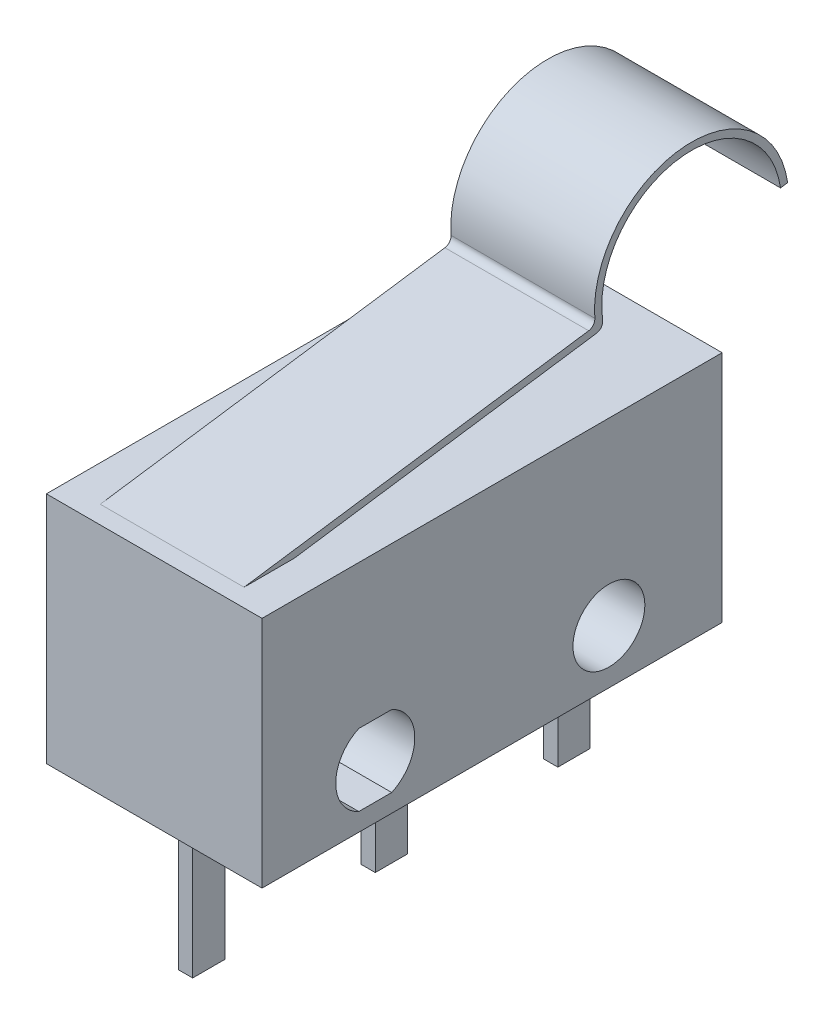
ISO-10303-21;
HEADER;
FILE_DESCRIPTION(('STEP AP214'),'2;1');
FILE_NAME('part.step','',(''),(''),'','','');
FILE_SCHEMA(('AUTOMOTIVE_DESIGN { 1 0 10303 214 1 1 1 1 }'));
ENDSEC;
DATA;
#1=APPLICATION_CONTEXT('core data for automotive mechanical design processes');
#2=APPLICATION_PROTOCOL_DEFINITION('international standard','automotive_design',2000,#1);
#3=PRODUCT_CONTEXT('',#1,'mechanical');
#4=PRODUCT('Part','Part','',(#3));
#5=PRODUCT_RELATED_PRODUCT_CATEGORY('part','',(#4));
#6=PRODUCT_DEFINITION_FORMATION('','',#4);
#7=PRODUCT_DEFINITION_CONTEXT('part definition',#1,'design');
#8=PRODUCT_DEFINITION('design','',#6,#7);
#9=PRODUCT_DEFINITION_SHAPE('','',#8);
#10=(LENGTH_UNIT() NAMED_UNIT(*) SI_UNIT(.MILLI.,.METRE.));
#11=(NAMED_UNIT(*) PLANE_ANGLE_UNIT() SI_UNIT($,.RADIAN.));
#12=(NAMED_UNIT(*) SI_UNIT($,.STERADIAN.) SOLID_ANGLE_UNIT());
#13=UNCERTAINTY_MEASURE_WITH_UNIT(LENGTH_MEASURE(1.E-05),#10,'distance_accuracy_value','');
#14=(GEOMETRIC_REPRESENTATION_CONTEXT(3) GLOBAL_UNCERTAINTY_ASSIGNED_CONTEXT((#13)) GLOBAL_UNIT_ASSIGNED_CONTEXT((#10,
#11,#12)) REPRESENTATION_CONTEXT('',''));
#15=CARTESIAN_POINT('',(0.,0.,0.));
#16=DIRECTION('',(0.,0.,1.));
#17=DIRECTION('',(1.,0.,0.));
#18=AXIS2_PLACEMENT_3D('',#15,#16,#17);
#19=CARTESIAN_POINT('',(3.,3.25,-6.4));
#20=DIRECTION('',(0.,-1.,0.));
#21=DIRECTION('',(0.,0.,-1.));
#22=AXIS2_PLACEMENT_3D('',#19,#20,#21);
#23=PLANE('',#22);
#24=DIRECTION('',(-1.,0.,0.));
#25=VECTOR('',#24,1.);
#26=CARTESIAN_POINT('',(0.5,3.25,1.82));
#27=LINE('',#26,#25);
#28=CARTESIAN_POINT('',(0.5,3.25,1.82));
#29=VERTEX_POINT('',#28);
#30=CARTESIAN_POINT('',(-0.5,3.25,1.82));
#31=VERTEX_POINT('',#30);
#32=EDGE_CURVE('E54',#29,#31,#27,.T.);
#33=ORIENTED_EDGE('',*,*,#32,.F.);
#34=DIRECTION('',(0.,0.,-1.));
#35=VECTOR('',#34,1.);
#36=CARTESIAN_POINT('',(0.5,3.25,2.48));
#37=LINE('',#36,#35);
#38=CARTESIAN_POINT('',(0.5,3.25,2.48));
#39=VERTEX_POINT('',#38);
#40=EDGE_CURVE('E49',#39,#29,#37,.T.);
#41=ORIENTED_EDGE('',*,*,#40,.F.);
#42=DIRECTION('',(-1.,0.,0.));
#43=VECTOR('',#42,1.);
#44=CARTESIAN_POINT('',(0.5,3.25,2.48));
#45=LINE('',#44,#43);
#46=CARTESIAN_POINT('',(-0.5,3.25,2.48));
#47=VERTEX_POINT('',#46);
#48=EDGE_CURVE('E226',#39,#47,#45,.T.);
#49=ORIENTED_EDGE('',*,*,#48,.T.);
#50=DIRECTION('',(0.,0.,-1.));
#51=VECTOR('',#50,1.);
#52=CARTESIAN_POINT('',(-0.5,3.25,2.48));
#53=LINE('',#52,#51);
#54=EDGE_CURVE('E229',#47,#31,#53,.T.);
#55=ORIENTED_EDGE('',*,*,#54,.T.);
#56=EDGE_LOOP('',(#33,#41,#49,#55));
#57=FACE_BOUND('',#56,.T.);
#58=DIRECTION('',(0.,0.,1.));
#59=VECTOR('',#58,1.);
#60=CARTESIAN_POINT('',(-3.,3.25,-6.4));
#61=LINE('',#60,#59);
#62=CARTESIAN_POINT('',(-3.,3.25,-6.4));
#63=VERTEX_POINT('',#62);
#64=CARTESIAN_POINT('',(-3.,3.25,6.4));
#65=VERTEX_POINT('',#64);
#66=EDGE_CURVE('E421',#63,#65,#61,.T.);
#67=ORIENTED_EDGE('',*,*,#66,.T.);
#68=DIRECTION('',(-1.,0.,0.));
#69=VECTOR('',#68,1.);
#70=CARTESIAN_POINT('',(3.,3.25,6.4));
#71=LINE('',#70,#69);
#72=CARTESIAN_POINT('',(3.,3.25,6.4));
#73=VERTEX_POINT('',#72);
#74=EDGE_CURVE('E427',#73,#65,#71,.T.);
#75=ORIENTED_EDGE('',*,*,#74,.F.);
#76=DIRECTION('',(0.,0.,1.));
#77=VECTOR('',#76,1.);
#78=CARTESIAN_POINT('',(3.,3.25,-6.4));
#79=LINE('',#78,#77);
#80=CARTESIAN_POINT('',(3.,3.25,-6.4));
#81=VERTEX_POINT('',#80);
#82=EDGE_CURVE('E425',#81,#73,#79,.T.);
#83=ORIENTED_EDGE('',*,*,#82,.F.);
#84=DIRECTION('',(-1.,0.,0.));
#85=VECTOR('',#84,1.);
#86=CARTESIAN_POINT('',(3.,3.25,-6.4));
#87=LINE('',#86,#85);
#88=EDGE_CURVE('E437',#81,#63,#87,.T.);
#89=ORIENTED_EDGE('',*,*,#88,.T.);
#90=EDGE_LOOP('',(#67,#75,#83,#89));
#91=FACE_BOUND('',#90,.T.);
#92=DIRECTION('',(0.,0.,-1.));
#93=VECTOR('',#92,1.);
#94=CARTESIAN_POINT('',(2.,3.25,4.5022836084845));
#95=LINE('',#94,#93);
#96=CARTESIAN_POINT('',(2.,3.25,5.9));
#97=VERTEX_POINT('',#96);
#98=CARTESIAN_POINT('',(2.,3.25,4.5022836084845));
#99=VERTEX_POINT('',#98);
#100=EDGE_CURVE('E247',#97,#99,#95,.T.);
#101=ORIENTED_EDGE('',*,*,#100,.F.);
#102=DIRECTION('',(-1.,0.,0.));
#103=VECTOR('',#102,1.);
#104=CARTESIAN_POINT('',(2.,3.25,5.9));
#105=LINE('',#104,#103);
#106=CARTESIAN_POINT('',(-2.,3.25,5.9));
#107=VERTEX_POINT('',#106);
#108=EDGE_CURVE('E263',#97,#107,#105,.T.);
#109=ORIENTED_EDGE('',*,*,#108,.T.);
#110=DIRECTION('',(0.,0.,-1.));
#111=VECTOR('',#110,1.);
#112=CARTESIAN_POINT('',(-2.,3.25,4.5022836084845));
#113=LINE('',#112,#111);
#114=CARTESIAN_POINT('',(-2.,3.25,4.5022836084845));
#115=VERTEX_POINT('',#114);
#116=EDGE_CURVE('E233',#107,#115,#113,.T.);
#117=ORIENTED_EDGE('',*,*,#116,.T.);
#118=DIRECTION('',(-1.,0.,0.));
#119=VECTOR('',#118,1.);
#120=CARTESIAN_POINT('',(2.,3.25,4.5022836084845));
#121=LINE('',#120,#119);
#122=EDGE_CURVE('E285',#99,#115,#121,.T.);
#123=ORIENTED_EDGE('',*,*,#122,.F.);
#124=EDGE_LOOP('',(#101,#109,#117,#123));
#125=FACE_BOUND('',#124,.T.);
#126=ADVANCED_FACE('F34',(#57,#91,#125),#23,.F.);
#127=CARTESIAN_POINT('',(3.,-3.25,-6.4));
#128=DIRECTION('',(0.,1.,0.));
#129=DIRECTION('',(0.,0.,1.));
#130=AXIS2_PLACEMENT_3D('',#127,#128,#129);
#131=PLANE('',#130);
#132=DIRECTION('',(-1.,0.,0.));
#133=VECTOR('',#132,1.);
#134=CARTESIAN_POINT('',(0.2,-3.25,-4.63));
#135=LINE('',#134,#133);
#136=CARTESIAN_POINT('',(0.2,-3.25,-4.63));
#137=VERTEX_POINT('',#136);
#138=CARTESIAN_POINT('',(-0.2,-3.25,-4.63));
#139=VERTEX_POINT('',#138);
#140=EDGE_CURVE('E300',#137,#139,#135,.T.);
#141=ORIENTED_EDGE('',*,*,#140,.F.);
#142=DIRECTION('',(0.,0.,1.));
#143=VECTOR('',#142,1.);
#144=CARTESIAN_POINT('',(0.2,-3.25,-4.63));
#145=LINE('',#144,#143);
#146=CARTESIAN_POINT('',(0.2,-3.25,-5.53));
#147=VERTEX_POINT('',#146);
#148=EDGE_CURVE('E297',#147,#137,#145,.T.);
#149=ORIENTED_EDGE('',*,*,#148,.F.);
#150=DIRECTION('',(-1.,0.,0.));
#151=VECTOR('',#150,1.);
#152=CARTESIAN_POINT('',(0.2,-3.25,-5.53));
#153=LINE('',#152,#151);
#154=CARTESIAN_POINT('',(-0.2,-3.25,-5.53));
#155=VERTEX_POINT('',#154);
#156=EDGE_CURVE('E311',#147,#155,#153,.T.);
#157=ORIENTED_EDGE('',*,*,#156,.T.);
#158=DIRECTION('',(0.,0.,1.));
#159=VECTOR('',#158,1.);
#160=CARTESIAN_POINT('',(-0.2,-3.25,-4.63));
#161=LINE('',#160,#159);
#162=EDGE_CURVE('E292',#155,#139,#161,.T.);
#163=ORIENTED_EDGE('',*,*,#162,.T.);
#164=EDGE_LOOP('',(#141,#149,#157,#163));
#165=FACE_BOUND('',#164,.T.);
#166=DIRECTION('',(0.,0.,-1.));
#167=VECTOR('',#166,1.);
#168=CARTESIAN_POINT('',(-3.,-3.25,-6.4));
#169=LINE('',#168,#167);
#170=CARTESIAN_POINT('',(-3.,-3.25,6.4));
#171=VERTEX_POINT('',#170);
#172=CARTESIAN_POINT('',(-3.,-3.25,-6.4));
#173=VERTEX_POINT('',#172);
#174=EDGE_CURVE('E430',#171,#173,#169,.T.);
#175=ORIENTED_EDGE('',*,*,#174,.T.);
#176=DIRECTION('',(-1.,0.,0.));
#177=VECTOR('',#176,1.);
#178=CARTESIAN_POINT('',(3.,-3.25,-6.4));
#179=LINE('',#178,#177);
#180=CARTESIAN_POINT('',(3.,-3.25,-6.4));
#181=VERTEX_POINT('',#180);
#182=EDGE_CURVE('E440',#181,#173,#179,.T.);
#183=ORIENTED_EDGE('',*,*,#182,.F.);
#184=DIRECTION('',(0.,0.,-1.));
#185=VECTOR('',#184,1.);
#186=CARTESIAN_POINT('',(3.,-3.25,-6.4));
#187=LINE('',#186,#185);
#188=CARTESIAN_POINT('',(3.,-3.25,6.4));
#189=VERTEX_POINT('',#188);
#190=EDGE_CURVE('E420',#189,#181,#187,.T.);
#191=ORIENTED_EDGE('',*,*,#190,.F.);
#192=DIRECTION('',(-1.,0.,0.));
#193=VECTOR('',#192,1.);
#194=CARTESIAN_POINT('',(3.,-3.25,6.4));
#195=LINE('',#194,#193);
#196=EDGE_CURVE('E443',#189,#171,#195,.T.);
#197=ORIENTED_EDGE('',*,*,#196,.T.);
#198=EDGE_LOOP('',(#175,#183,#191,#197));
#199=FACE_BOUND('',#198,.T.);
#200=DIRECTION('',(-1.,0.,0.));
#201=VECTOR('',#200,1.);
#202=CARTESIAN_POINT('',(0.2,-3.25,5.53));
#203=LINE('',#202,#201);
#204=CARTESIAN_POINT('',(0.2,-3.25,5.53));
#205=VERTEX_POINT('',#204);
#206=CARTESIAN_POINT('',(-0.2,-3.25,5.53));
#207=VERTEX_POINT('',#206);
#208=EDGE_CURVE('E376',#205,#207,#203,.T.);
#209=ORIENTED_EDGE('',*,*,#208,.F.);
#210=DIRECTION('',(0.,0.,1.));
#211=VECTOR('',#210,1.);
#212=CARTESIAN_POINT('',(0.2,-3.25,4.63));
#213=LINE('',#212,#211);
#214=CARTESIAN_POINT('',(0.2,-3.25,4.63));
#215=VERTEX_POINT('',#214);
#216=EDGE_CURVE('E350',#215,#205,#213,.T.);
#217=ORIENTED_EDGE('',*,*,#216,.F.);
#218=DIRECTION('',(-1.,0.,0.));
#219=VECTOR('',#218,1.);
#220=CARTESIAN_POINT('',(0.2,-3.25,4.63));
#221=LINE('',#220,#219);
#222=CARTESIAN_POINT('',(-0.2,-3.25,4.63));
#223=VERTEX_POINT('',#222);
#224=EDGE_CURVE('E361',#215,#223,#221,.T.);
#225=ORIENTED_EDGE('',*,*,#224,.T.);
#226=DIRECTION('',(0.,0.,1.));
#227=VECTOR('',#226,1.);
#228=CARTESIAN_POINT('',(-0.2,-3.25,4.63));
#229=LINE('',#228,#227);
#230=EDGE_CURVE('E349',#223,#207,#229,.T.);
#231=ORIENTED_EDGE('',*,*,#230,.T.);
#232=EDGE_LOOP('',(#209,#217,#225,#231));
#233=FACE_BOUND('',#232,.T.);
#234=DIRECTION('',(0.,0.,1.));
#235=VECTOR('',#234,1.);
#236=CARTESIAN_POINT('',(0.2,-3.25,-0.45));
#237=LINE('',#236,#235);
#238=CARTESIAN_POINT('',(0.2,-3.25,-0.45));
#239=VERTEX_POINT('',#238);
#240=CARTESIAN_POINT('',(0.2,-3.25,0.45));
#241=VERTEX_POINT('',#240);
#242=EDGE_CURVE('E322',#239,#241,#237,.T.);
#243=ORIENTED_EDGE('',*,*,#242,.F.);
#244=DIRECTION('',(-1.,0.,0.));
#245=VECTOR('',#244,1.);
#246=CARTESIAN_POINT('',(0.2,-3.25,-0.45));
#247=LINE('',#246,#245);
#248=CARTESIAN_POINT('',(-0.2,-3.25,-0.45));
#249=VERTEX_POINT('',#248);
#250=EDGE_CURVE('E346',#239,#249,#247,.T.);
#251=ORIENTED_EDGE('',*,*,#250,.T.);
#252=DIRECTION('',(0.,0.,1.));
#253=VECTOR('',#252,1.);
#254=CARTESIAN_POINT('',(-0.2,-3.25,-0.45));
#255=LINE('',#254,#253);
#256=CARTESIAN_POINT('',(-0.2,-3.25,0.450000000000001));
#257=VERTEX_POINT('',#256);
#258=EDGE_CURVE('E332',#249,#257,#255,.T.);
#259=ORIENTED_EDGE('',*,*,#258,.T.);
#260=DIRECTION('',(-1.,0.,0.));
#261=VECTOR('',#260,1.);
#262=CARTESIAN_POINT('',(0.2,-3.25,0.45));
#263=LINE('',#262,#261);
#264=EDGE_CURVE('E343',#241,#257,#263,.T.);
#265=ORIENTED_EDGE('',*,*,#264,.F.);
#266=EDGE_LOOP('',(#243,#251,#259,#265));
#267=FACE_BOUND('',#266,.T.);
#268=ADVANCED_FACE('F507',(#165,#199,#233,#267),#131,.F.);
#269=CARTESIAN_POINT('',(3.,0.,0.));
#270=DIRECTION('',(-1.,0.,0.));
#271=DIRECTION('',(0.,0.,1.));
#272=AXIS2_PLACEMENT_3D('',#269,#270,#271);
#273=PLANE('',#272);
#274=CARTESIAN_POINT('',(3.,-1.75,-3.25));
#275=DIRECTION('',(1.,0.,0.));
#276=DIRECTION('',(0.,0.,-1.));
#277=AXIS2_PLACEMENT_3D('',#274,#275,#276);
#278=CIRCLE('',#277,0.999999999999999);
#279=CARTESIAN_POINT('',(3.,-1.75,-4.25));
#280=VERTEX_POINT('',#279);
#281=EDGE_CURVE('E411',#280,#280,#278,.T.);
#282=ORIENTED_EDGE('',*,*,#281,.F.);
#283=EDGE_LOOP('',(#282));
#284=FACE_BOUND('',#283,.T.);
#285=DIRECTION('',(0.,-1.,0.));
#286=VECTOR('',#285,1.);
#287=CARTESIAN_POINT('',(3.,3.25,6.4));
#288=LINE('',#287,#286);
#289=EDGE_CURVE('E417',#73,#189,#288,.T.);
#290=ORIENTED_EDGE('',*,*,#289,.T.);
#291=ORIENTED_EDGE('',*,*,#190,.T.);
#292=DIRECTION('',(0.,1.,0.));
#293=VECTOR('',#292,1.);
#294=CARTESIAN_POINT('',(3.,3.25,-6.4));
#295=LINE('',#294,#293);
#296=EDGE_CURVE('E423',#181,#81,#295,.T.);
#297=ORIENTED_EDGE('',*,*,#296,.T.);
#298=ORIENTED_EDGE('',*,*,#82,.T.);
#299=EDGE_LOOP('',(#290,#291,#297,#298));
#300=FACE_BOUND('',#299,.T.);
#301=CARTESIAN_POINT('',(3.,-1.75,3.25));
#302=DIRECTION('',(1.,0.,0.));
#303=DIRECTION('',(0.,0.,-1.));
#304=AXIS2_PLACEMENT_3D('',#301,#302,#303);
#305=CIRCLE('',#304,1.1);
#306=CARTESIAN_POINT('',(3.,-0.75,3.70825756949558));
#307=VERTEX_POINT('',#306);
#308=CARTESIAN_POINT('',(3.,-2.75,3.70825756949558));
#309=VERTEX_POINT('',#308);
#310=EDGE_CURVE('E380',#307,#309,#305,.T.);
#311=ORIENTED_EDGE('',*,*,#310,.F.);
#312=DIRECTION('',(0.,0.,1.));
#313=VECTOR('',#312,1.);
#314=CARTESIAN_POINT('',(3.,-0.75,3.70825756949558));
#315=LINE('',#314,#313);
#316=CARTESIAN_POINT('',(3.,-0.75,2.79174243050441));
#317=VERTEX_POINT('',#316);
#318=EDGE_CURVE('E388',#317,#307,#315,.T.);
#319=ORIENTED_EDGE('',*,*,#318,.F.);
#320=CARTESIAN_POINT('',(3.,-1.75,3.25));
#321=DIRECTION('',(1.,0.,0.));
#322=DIRECTION('',(0.,0.,-1.));
#323=AXIS2_PLACEMENT_3D('',#320,#321,#322);
#324=CIRCLE('',#323,1.1);
#325=CARTESIAN_POINT('',(3.,-2.75,2.79174243050442));
#326=VERTEX_POINT('',#325);
#327=EDGE_CURVE('E385',#326,#317,#324,.T.);
#328=ORIENTED_EDGE('',*,*,#327,.F.);
#329=DIRECTION('',(0.,0.,-1.));
#330=VECTOR('',#329,1.);
#331=CARTESIAN_POINT('',(3.,-2.75,3.70825756949558));
#332=LINE('',#331,#330);
#333=EDGE_CURVE('E382',#309,#326,#332,.T.);
#334=ORIENTED_EDGE('',*,*,#333,.F.);
#335=EDGE_LOOP('',(#311,#319,#328,#334));
#336=FACE_BOUND('',#335,.T.);
#337=ADVANCED_FACE('F512',(#284,#300,#336),#273,.F.);
#338=CARTESIAN_POINT('',(-3.,0.,0.));
#339=DIRECTION('',(-1.,0.,0.));
#340=DIRECTION('',(0.,0.,1.));
#341=AXIS2_PLACEMENT_3D('',#338,#339,#340);
#342=PLANE('',#341);
#343=DIRECTION('',(0.,-1.,0.));
#344=VECTOR('',#343,1.);
#345=CARTESIAN_POINT('',(-3.,3.25,6.4));
#346=LINE('',#345,#344);
#347=EDGE_CURVE('E414',#65,#171,#346,.T.);
#348=ORIENTED_EDGE('',*,*,#347,.F.);
#349=ORIENTED_EDGE('',*,*,#66,.F.);
#350=DIRECTION('',(0.,1.,0.));
#351=VECTOR('',#350,1.);
#352=CARTESIAN_POINT('',(-3.,3.25,-6.4));
#353=LINE('',#352,#351);
#354=EDGE_CURVE('E432',#173,#63,#353,.T.);
#355=ORIENTED_EDGE('',*,*,#354,.F.);
#356=ORIENTED_EDGE('',*,*,#174,.F.);
#357=EDGE_LOOP('',(#348,#349,#355,#356));
#358=FACE_BOUND('',#357,.T.);
#359=CARTESIAN_POINT('',(-3.,-1.75,-3.25));
#360=DIRECTION('',(1.,0.,0.));
#361=DIRECTION('',(0.,0.,-1.));
#362=AXIS2_PLACEMENT_3D('',#359,#360,#361);
#363=CIRCLE('',#362,0.999999999999999);
#364=CARTESIAN_POINT('',(-3.,-1.75,-4.25));
#365=VERTEX_POINT('',#364);
#366=EDGE_CURVE('E410',#365,#365,#363,.T.);
#367=ORIENTED_EDGE('',*,*,#366,.T.);
#368=EDGE_LOOP('',(#367));
#369=FACE_BOUND('',#368,.T.);
#370=DIRECTION('',(0.,0.,1.));
#371=VECTOR('',#370,1.);
#372=CARTESIAN_POINT('',(-3.,-0.75,3.70825756949558));
#373=LINE('',#372,#371);
#374=CARTESIAN_POINT('',(-3.,-0.75,2.79174243050441));
#375=VERTEX_POINT('',#374);
#376=CARTESIAN_POINT('',(-3.,-0.75,3.70825756949558));
#377=VERTEX_POINT('',#376);
#378=EDGE_CURVE('E383',#375,#377,#373,.T.);
#379=ORIENTED_EDGE('',*,*,#378,.T.);
#380=CARTESIAN_POINT('',(-3.,-1.75,3.25));
#381=DIRECTION('',(1.,0.,0.));
#382=DIRECTION('',(0.,0.,-1.));
#383=AXIS2_PLACEMENT_3D('',#380,#381,#382);
#384=CIRCLE('',#383,1.1);
#385=CARTESIAN_POINT('',(-3.,-2.75,3.70825756949558));
#386=VERTEX_POINT('',#385);
#387=EDGE_CURVE('E379',#377,#386,#384,.T.);
#388=ORIENTED_EDGE('',*,*,#387,.T.);
#389=DIRECTION('',(0.,0.,-1.));
#390=VECTOR('',#389,1.);
#391=CARTESIAN_POINT('',(-3.,-2.75,3.70825756949558));
#392=LINE('',#391,#390);
#393=CARTESIAN_POINT('',(-3.,-2.75,2.79174243050442));
#394=VERTEX_POINT('',#393);
#395=EDGE_CURVE('E393',#386,#394,#392,.T.);
#396=ORIENTED_EDGE('',*,*,#395,.T.);
#397=CARTESIAN_POINT('',(-3.,-1.75,3.25));
#398=DIRECTION('',(1.,0.,0.));
#399=DIRECTION('',(0.,0.,-1.));
#400=AXIS2_PLACEMENT_3D('',#397,#398,#399);
#401=CIRCLE('',#400,1.1);
#402=EDGE_CURVE('E396',#394,#375,#401,.T.);
#403=ORIENTED_EDGE('',*,*,#402,.T.);
#404=EDGE_LOOP('',(#379,#388,#396,#403));
#405=FACE_BOUND('',#404,.T.);
#406=ADVANCED_FACE('F517',(#358,#369,#405),#342,.T.);
#407=CARTESIAN_POINT('',(3.,3.25,6.4));
#408=DIRECTION('',(0.,0.,-1.));
#409=DIRECTION('',(0.,1.,0.));
#410=AXIS2_PLACEMENT_3D('',#407,#408,#409);
#411=PLANE('',#410);
#412=ORIENTED_EDGE('',*,*,#347,.T.);
#413=ORIENTED_EDGE('',*,*,#196,.F.);
#414=ORIENTED_EDGE('',*,*,#289,.F.);
#415=ORIENTED_EDGE('',*,*,#74,.T.);
#416=EDGE_LOOP('',(#412,#413,#414,#415));
#417=FACE_BOUND('',#416,.T.);
#418=ADVANCED_FACE('F522',(#417),#411,.F.);
#419=CARTESIAN_POINT('',(3.,3.25,-6.4));
#420=DIRECTION('',(0.,0.,1.));
#421=DIRECTION('',(1.,0.,0.));
#422=AXIS2_PLACEMENT_3D('',#419,#420,#421);
#423=PLANE('',#422);
#424=ORIENTED_EDGE('',*,*,#354,.T.);
#425=ORIENTED_EDGE('',*,*,#88,.F.);
#426=ORIENTED_EDGE('',*,*,#296,.F.);
#427=ORIENTED_EDGE('',*,*,#182,.T.);
#428=EDGE_LOOP('',(#424,#425,#426,#427));
#429=FACE_BOUND('',#428,.T.);
#430=ADVANCED_FACE('F519',(#429),#423,.F.);
#431=CARTESIAN_POINT('',(3.,-1.75,-3.25));
#432=DIRECTION('',(-1.,0.,0.));
#433=DIRECTION('',(0.,0.,1.));
#434=AXIS2_PLACEMENT_3D('',#431,#432,#433);
#435=CYLINDRICAL_SURFACE('',#434,0.999999999999999);
#436=ORIENTED_EDGE('',*,*,#281,.T.);
#437=EDGE_LOOP('',(#436));
#438=FACE_BOUND('',#437,.T.);
#439=ORIENTED_EDGE('',*,*,#366,.F.);
#440=EDGE_LOOP('',(#439));
#441=FACE_BOUND('',#440,.T.);
#442=ADVANCED_FACE('F521',(#438,#441),#435,.F.);
#443=CARTESIAN_POINT('',(3.,-1.75,3.25));
#444=DIRECTION('',(-1.,0.,0.));
#445=DIRECTION('',(0.,0.,1.));
#446=AXIS2_PLACEMENT_3D('',#443,#444,#445);
#447=CYLINDRICAL_SURFACE('',#446,1.1);
#448=ORIENTED_EDGE('',*,*,#387,.F.);
#449=DIRECTION('',(-1.,0.,0.));
#450=VECTOR('',#449,1.);
#451=CARTESIAN_POINT('',(3.,-0.75,3.70825756949558));
#452=LINE('',#451,#450);
#453=EDGE_CURVE('E390',#307,#377,#452,.T.);
#454=ORIENTED_EDGE('',*,*,#453,.F.);
#455=ORIENTED_EDGE('',*,*,#310,.T.);
#456=DIRECTION('',(-1.,0.,0.));
#457=VECTOR('',#456,1.);
#458=CARTESIAN_POINT('',(3.,-2.75,3.70825756949558));
#459=LINE('',#458,#457);
#460=EDGE_CURVE('E407',#309,#386,#459,.T.);
#461=ORIENTED_EDGE('',*,*,#460,.T.);
#462=EDGE_LOOP('',(#448,#454,#455,#461));
#463=FACE_BOUND('',#462,.T.);
#464=ADVANCED_FACE('F800',(#463),#447,.F.);
#465=CARTESIAN_POINT('',(3.,-2.75,3.70825756949558));
#466=DIRECTION('',(0.,1.,0.));
#467=DIRECTION('',(0.,0.,1.));
#468=AXIS2_PLACEMENT_3D('',#465,#466,#467);
#469=PLANE('',#468);
#470=ORIENTED_EDGE('',*,*,#395,.F.);
#471=ORIENTED_EDGE('',*,*,#460,.F.);
#472=ORIENTED_EDGE('',*,*,#333,.T.);
#473=DIRECTION('',(-1.,0.,0.));
#474=VECTOR('',#473,1.);
#475=CARTESIAN_POINT('',(3.,-2.75,2.79174243050442));
#476=LINE('',#475,#474);
#477=EDGE_CURVE('E405',#326,#394,#476,.T.);
#478=ORIENTED_EDGE('',*,*,#477,.T.);
#479=EDGE_LOOP('',(#470,#471,#472,#478));
#480=FACE_BOUND('',#479,.T.);
#481=ADVANCED_FACE('F790',(#480),#469,.T.);
#482=CARTESIAN_POINT('',(3.,-1.75,3.25));
#483=DIRECTION('',(-1.,0.,0.));
#484=DIRECTION('',(0.,0.,1.));
#485=AXIS2_PLACEMENT_3D('',#482,#483,#484);
#486=CYLINDRICAL_SURFACE('',#485,1.1);
#487=ORIENTED_EDGE('',*,*,#402,.F.);
#488=ORIENTED_EDGE('',*,*,#477,.F.);
#489=ORIENTED_EDGE('',*,*,#327,.T.);
#490=DIRECTION('',(-1.,0.,0.));
#491=VECTOR('',#490,1.);
#492=CARTESIAN_POINT('',(3.,-0.75,2.79174243050441));
#493=LINE('',#492,#491);
#494=EDGE_CURVE('E403',#317,#375,#493,.T.);
#495=ORIENTED_EDGE('',*,*,#494,.T.);
#496=EDGE_LOOP('',(#487,#488,#489,#495));
#497=FACE_BOUND('',#496,.T.);
#498=ADVANCED_FACE('F780',(#497),#486,.F.);
#499=CARTESIAN_POINT('',(3.,-0.75,3.70825756949558));
#500=DIRECTION('',(0.,-1.,0.));
#501=DIRECTION('',(0.,0.,-1.));
#502=AXIS2_PLACEMENT_3D('',#499,#500,#501);
#503=PLANE('',#502);
#504=ORIENTED_EDGE('',*,*,#378,.F.);
#505=ORIENTED_EDGE('',*,*,#494,.F.);
#506=ORIENTED_EDGE('',*,*,#318,.T.);
#507=ORIENTED_EDGE('',*,*,#453,.T.);
#508=EDGE_LOOP('',(#504,#505,#506,#507));
#509=FACE_BOUND('',#508,.T.);
#510=ADVANCED_FACE('F763',(#509),#503,.T.);
#511=CARTESIAN_POINT('',(0.2,-3.25,5.53));
#512=DIRECTION('',(0.,0.,-1.));
#513=DIRECTION('',(0.,1.,0.));
#514=AXIS2_PLACEMENT_3D('',#511,#512,#513);
#515=PLANE('',#514);
#516=DIRECTION('',(0.,-1.,0.));
#517=VECTOR('',#516,1.);
#518=CARTESIAN_POINT('',(-0.2,-3.25,5.53));
#519=LINE('',#518,#517);
#520=CARTESIAN_POINT('',(-0.2,-7.25,5.53));
#521=VERTEX_POINT('',#520);
#522=EDGE_CURVE('E363',#207,#521,#519,.T.);
#523=ORIENTED_EDGE('',*,*,#522,.T.);
#524=DIRECTION('',(-1.,0.,0.));
#525=VECTOR('',#524,1.);
#526=CARTESIAN_POINT('',(0.2,-7.25,5.53));
#527=LINE('',#526,#525);
#528=CARTESIAN_POINT('',(0.2,-7.25,5.53));
#529=VERTEX_POINT('',#528);
#530=EDGE_CURVE('E373',#529,#521,#527,.T.);
#531=ORIENTED_EDGE('',*,*,#530,.F.);
#532=DIRECTION('',(0.,-1.,0.));
#533=VECTOR('',#532,1.);
#534=CARTESIAN_POINT('',(0.2,-3.25,5.53));
#535=LINE('',#534,#533);
#536=EDGE_CURVE('E353',#205,#529,#535,.T.);
#537=ORIENTED_EDGE('',*,*,#536,.F.);
#538=ORIENTED_EDGE('',*,*,#208,.T.);
#539=EDGE_LOOP('',(#523,#531,#537,#538));
#540=FACE_BOUND('',#539,.T.);
#541=ADVANCED_FACE('F753',(#540),#515,.F.);
#542=CARTESIAN_POINT('',(0.2,-7.25,5.53));
#543=DIRECTION('',(0.,1.,0.));
#544=DIRECTION('',(0.,0.,1.));
#545=AXIS2_PLACEMENT_3D('',#542,#543,#544);
#546=PLANE('',#545);
#547=DIRECTION('',(0.,0.,-1.));
#548=VECTOR('',#547,1.);
#549=CARTESIAN_POINT('',(-0.2,-7.25,5.53));
#550=LINE('',#549,#548);
#551=CARTESIAN_POINT('',(-0.2,-7.25,4.63));
#552=VERTEX_POINT('',#551);
#553=EDGE_CURVE('E365',#521,#552,#550,.T.);
#554=ORIENTED_EDGE('',*,*,#553,.T.);
#555=DIRECTION('',(-1.,0.,0.));
#556=VECTOR('',#555,1.);
#557=CARTESIAN_POINT('',(0.2,-7.25,4.63));
#558=LINE('',#557,#556);
#559=CARTESIAN_POINT('',(0.2,-7.25,4.63));
#560=VERTEX_POINT('',#559);
#561=EDGE_CURVE('E370',#560,#552,#558,.T.);
#562=ORIENTED_EDGE('',*,*,#561,.F.);
#563=DIRECTION('',(0.,0.,-1.));
#564=VECTOR('',#563,1.);
#565=CARTESIAN_POINT('',(0.2,-7.25,5.53));
#566=LINE('',#565,#564);
#567=EDGE_CURVE('E356',#529,#560,#566,.T.);
#568=ORIENTED_EDGE('',*,*,#567,.F.);
#569=ORIENTED_EDGE('',*,*,#530,.T.);
#570=EDGE_LOOP('',(#554,#562,#568,#569));
#571=FACE_BOUND('',#570,.T.);
#572=ADVANCED_FACE('F743',(#571),#546,.F.);
#573=CARTESIAN_POINT('',(0.2,-7.25,4.63));
#574=DIRECTION('',(0.,0.,1.));
#575=DIRECTION('',(1.,0.,0.));
#576=AXIS2_PLACEMENT_3D('',#573,#574,#575);
#577=PLANE('',#576);
#578=DIRECTION('',(0.,1.,0.));
#579=VECTOR('',#578,1.);
#580=CARTESIAN_POINT('',(-0.2,-7.25,4.63));
#581=LINE('',#580,#579);
#582=EDGE_CURVE('E354',#552,#223,#581,.T.);
#583=ORIENTED_EDGE('',*,*,#582,.T.);
#584=ORIENTED_EDGE('',*,*,#224,.F.);
#585=DIRECTION('',(0.,1.,0.));
#586=VECTOR('',#585,1.);
#587=CARTESIAN_POINT('',(0.2,-7.25,4.63));
#588=LINE('',#587,#586);
#589=EDGE_CURVE('E358',#560,#215,#588,.T.);
#590=ORIENTED_EDGE('',*,*,#589,.F.);
#591=ORIENTED_EDGE('',*,*,#561,.T.);
#592=EDGE_LOOP('',(#583,#584,#590,#591));
#593=FACE_BOUND('',#592,.T.);
#594=ADVANCED_FACE('F733',(#593),#577,.F.);
#595=CARTESIAN_POINT('',(0.2,0.,0.));
#596=DIRECTION('',(1.,0.,0.));
#597=DIRECTION('',(0.,0.,-1.));
#598=AXIS2_PLACEMENT_3D('',#595,#596,#597);
#599=PLANE('',#598);
#600=ORIENTED_EDGE('',*,*,#216,.T.);
#601=ORIENTED_EDGE('',*,*,#536,.T.);
#602=ORIENTED_EDGE('',*,*,#567,.T.);
#603=ORIENTED_EDGE('',*,*,#589,.T.);
#604=EDGE_LOOP('',(#600,#601,#602,#603));
#605=FACE_BOUND('',#604,.T.);
#606=ADVANCED_FACE('F723',(#605),#599,.T.);
#607=CARTESIAN_POINT('',(-0.2,0.,0.));
#608=DIRECTION('',(1.,0.,0.));
#609=DIRECTION('',(0.,0.,-1.));
#610=AXIS2_PLACEMENT_3D('',#607,#608,#609);
#611=PLANE('',#610);
#612=ORIENTED_EDGE('',*,*,#230,.F.);
#613=ORIENTED_EDGE('',*,*,#582,.F.);
#614=ORIENTED_EDGE('',*,*,#553,.F.);
#615=ORIENTED_EDGE('',*,*,#522,.F.);
#616=EDGE_LOOP('',(#612,#613,#614,#615));
#617=FACE_BOUND('',#616,.T.);
#618=ADVANCED_FACE('F713',(#617),#611,.F.);
#619=CARTESIAN_POINT('',(0.2,-3.25,-0.45));
#620=DIRECTION('',(0.,0.,1.));
#621=DIRECTION('',(0.,-1.,0.));
#622=AXIS2_PLACEMENT_3D('',#619,#620,#621);
#623=PLANE('',#622);
#624=DIRECTION('',(0.,1.,0.));
#625=VECTOR('',#624,1.);
#626=CARTESIAN_POINT('',(-0.2,-3.25,-0.45));
#627=LINE('',#626,#625);
#628=CARTESIAN_POINT('',(-0.2,-7.25,-0.45));
#629=VERTEX_POINT('',#628);
#630=EDGE_CURVE('E319',#629,#249,#627,.T.);
#631=ORIENTED_EDGE('',*,*,#630,.T.);
#632=ORIENTED_EDGE('',*,*,#250,.F.);
#633=DIRECTION('',(0.,1.,0.));
#634=VECTOR('',#633,1.);
#635=CARTESIAN_POINT('',(0.2,-3.25,-0.45));
#636=LINE('',#635,#634);
#637=CARTESIAN_POINT('',(0.2,-7.25,-0.45));
#638=VERTEX_POINT('',#637);
#639=EDGE_CURVE('E320',#638,#239,#636,.T.);
#640=ORIENTED_EDGE('',*,*,#639,.F.);
#641=DIRECTION('',(-1.,0.,0.));
#642=VECTOR('',#641,1.);
#643=CARTESIAN_POINT('',(0.2,-7.25,-0.45));
#644=LINE('',#643,#642);
#645=EDGE_CURVE('E329',#638,#629,#644,.T.);
#646=ORIENTED_EDGE('',*,*,#645,.T.);
#647=EDGE_LOOP('',(#631,#632,#640,#646));
#648=FACE_BOUND('',#647,.T.);
#649=ADVANCED_FACE('F703',(#648),#623,.F.);
#650=CARTESIAN_POINT('',(0.2,-3.25,0.45));
#651=DIRECTION('',(0.,0.,-1.));
#652=DIRECTION('',(0.,1.,0.));
#653=AXIS2_PLACEMENT_3D('',#650,#651,#652);
#654=PLANE('',#653);
#655=DIRECTION('',(0.,-1.,0.));
#656=VECTOR('',#655,1.);
#657=CARTESIAN_POINT('',(-0.2,-3.25,0.45));
#658=LINE('',#657,#656);
#659=CARTESIAN_POINT('',(-0.2,-7.25,0.45));
#660=VERTEX_POINT('',#659);
#661=EDGE_CURVE('E335',#257,#660,#658,.T.);
#662=ORIENTED_EDGE('',*,*,#661,.T.);
#663=DIRECTION('',(-1.,0.,0.));
#664=VECTOR('',#663,1.);
#665=CARTESIAN_POINT('',(0.2,-7.25,0.45));
#666=LINE('',#665,#664);
#667=CARTESIAN_POINT('',(0.2,-7.25,0.45));
#668=VERTEX_POINT('',#667);
#669=EDGE_CURVE('E340',#668,#660,#666,.T.);
#670=ORIENTED_EDGE('',*,*,#669,.F.);
#671=DIRECTION('',(0.,-1.,0.));
#672=VECTOR('',#671,1.);
#673=CARTESIAN_POINT('',(0.2,-3.25,0.45));
#674=LINE('',#673,#672);
#675=EDGE_CURVE('E325',#241,#668,#674,.T.);
#676=ORIENTED_EDGE('',*,*,#675,.F.);
#677=ORIENTED_EDGE('',*,*,#264,.T.);
#678=EDGE_LOOP('',(#662,#670,#676,#677));
#679=FACE_BOUND('',#678,.T.);
#680=ADVANCED_FACE('F693',(#679),#654,.F.);
#681=CARTESIAN_POINT('',(0.2,-7.25,-0.45));
#682=DIRECTION('',(0.,1.,0.));
#683=DIRECTION('',(0.,0.,1.));
#684=AXIS2_PLACEMENT_3D('',#681,#682,#683);
#685=PLANE('',#684);
#686=DIRECTION('',(0.,0.,-1.));
#687=VECTOR('',#686,1.);
#688=CARTESIAN_POINT('',(-0.2,-7.25,-0.45));
#689=LINE('',#688,#687);
#690=EDGE_CURVE('E323',#660,#629,#689,.T.);
#691=ORIENTED_EDGE('',*,*,#690,.T.);
#692=ORIENTED_EDGE('',*,*,#645,.F.);
#693=DIRECTION('',(0.,0.,-1.));
#694=VECTOR('',#693,1.);
#695=CARTESIAN_POINT('',(0.2,-7.25,-0.45));
#696=LINE('',#695,#694);
#697=EDGE_CURVE('E327',#668,#638,#696,.T.);
#698=ORIENTED_EDGE('',*,*,#697,.F.);
#699=ORIENTED_EDGE('',*,*,#669,.T.);
#700=EDGE_LOOP('',(#691,#692,#698,#699));
#701=FACE_BOUND('',#700,.T.);
#702=ADVANCED_FACE('F683',(#701),#685,.F.);
#703=CARTESIAN_POINT('',(0.2,0.,0.));
#704=DIRECTION('',(-1.,0.,0.));
#705=DIRECTION('',(0.,0.,1.));
#706=AXIS2_PLACEMENT_3D('',#703,#704,#705);
#707=PLANE('',#706);
#708=ORIENTED_EDGE('',*,*,#639,.T.);
#709=ORIENTED_EDGE('',*,*,#242,.T.);
#710=ORIENTED_EDGE('',*,*,#675,.T.);
#711=ORIENTED_EDGE('',*,*,#697,.T.);
#712=EDGE_LOOP('',(#708,#709,#710,#711));
#713=FACE_BOUND('',#712,.T.);
#714=ADVANCED_FACE('F673',(#713),#707,.F.);
#715=CARTESIAN_POINT('',(-0.2,0.,0.));
#716=DIRECTION('',(-1.,0.,0.));
#717=DIRECTION('',(0.,0.,1.));
#718=AXIS2_PLACEMENT_3D('',#715,#716,#717);
#719=PLANE('',#718);
#720=ORIENTED_EDGE('',*,*,#630,.F.);
#721=ORIENTED_EDGE('',*,*,#690,.F.);
#722=ORIENTED_EDGE('',*,*,#661,.F.);
#723=ORIENTED_EDGE('',*,*,#258,.F.);
#724=EDGE_LOOP('',(#720,#721,#722,#723));
#725=FACE_BOUND('',#724,.T.);
#726=ADVANCED_FACE('F663',(#725),#719,.T.);
#727=CARTESIAN_POINT('',(0.2,-3.25,-4.63));
#728=DIRECTION('',(0.,0.,-1.));
#729=DIRECTION('',(-1.,0.,0.));
#730=AXIS2_PLACEMENT_3D('',#727,#728,#729);
#731=PLANE('',#730);
#732=DIRECTION('',(0.,-1.,0.));
#733=VECTOR('',#732,1.);
#734=CARTESIAN_POINT('',(-0.2,-3.25,-4.63));
#735=LINE('',#734,#733);
#736=CARTESIAN_POINT('',(-0.2,-7.25,-4.63));
#737=VERTEX_POINT('',#736);
#738=EDGE_CURVE('E287',#139,#737,#735,.T.);
#739=ORIENTED_EDGE('',*,*,#738,.T.);
#740=DIRECTION('',(-1.,0.,0.));
#741=VECTOR('',#740,1.);
#742=CARTESIAN_POINT('',(0.2,-7.25,-4.63));
#743=LINE('',#742,#741);
#744=CARTESIAN_POINT('',(0.2,-7.25,-4.63));
#745=VERTEX_POINT('',#744);
#746=EDGE_CURVE('E316',#745,#737,#743,.T.);
#747=ORIENTED_EDGE('',*,*,#746,.F.);
#748=DIRECTION('',(0.,-1.,0.));
#749=VECTOR('',#748,1.);
#750=CARTESIAN_POINT('',(0.2,-3.25,-4.63));
#751=LINE('',#750,#749);
#752=EDGE_CURVE('E288',#137,#745,#751,.T.);
#753=ORIENTED_EDGE('',*,*,#752,.F.);
#754=ORIENTED_EDGE('',*,*,#140,.T.);
#755=EDGE_LOOP('',(#739,#747,#753,#754));
#756=FACE_BOUND('',#755,.T.);
#757=ADVANCED_FACE('F653',(#756),#731,.F.);
#758=CARTESIAN_POINT('',(0.2,-7.25,-4.63));
#759=DIRECTION('',(0.,1.,0.));
#760=DIRECTION('',(0.,0.,1.));
#761=AXIS2_PLACEMENT_3D('',#758,#759,#760);
#762=PLANE('',#761);
#763=DIRECTION('',(0.,0.,-1.));
#764=VECTOR('',#763,1.);
#765=CARTESIAN_POINT('',(-0.2,-7.25,-4.63));
#766=LINE('',#765,#764);
#767=CARTESIAN_POINT('',(-0.2,-7.25,-5.53));
#768=VERTEX_POINT('',#767);
#769=EDGE_CURVE('E303',#737,#768,#766,.T.);
#770=ORIENTED_EDGE('',*,*,#769,.T.);
#771=DIRECTION('',(-1.,0.,0.));
#772=VECTOR('',#771,1.);
#773=CARTESIAN_POINT('',(0.2,-7.25,-5.53));
#774=LINE('',#773,#772);
#775=CARTESIAN_POINT('',(0.2,-7.25,-5.53));
#776=VERTEX_POINT('',#775);
#777=EDGE_CURVE('E313',#776,#768,#774,.T.);
#778=ORIENTED_EDGE('',*,*,#777,.F.);
#779=DIRECTION('',(0.,0.,-1.));
#780=VECTOR('',#779,1.);
#781=CARTESIAN_POINT('',(0.2,-7.25,-4.63));
#782=LINE('',#781,#780);
#783=EDGE_CURVE('E291',#745,#776,#782,.T.);
#784=ORIENTED_EDGE('',*,*,#783,.F.);
#785=ORIENTED_EDGE('',*,*,#746,.T.);
#786=EDGE_LOOP('',(#770,#778,#784,#785));
#787=FACE_BOUND('',#786,.T.);
#788=ADVANCED_FACE('F643',(#787),#762,.F.);
#789=CARTESIAN_POINT('',(0.2,-3.25,-5.53));
#790=DIRECTION('',(0.,0.,1.));
#791=DIRECTION('',(0.,-1.,0.));
#792=AXIS2_PLACEMENT_3D('',#789,#790,#791);
#793=PLANE('',#792);
#794=DIRECTION('',(0.,1.,0.));
#795=VECTOR('',#794,1.);
#796=CARTESIAN_POINT('',(-0.2,-3.25,-5.53));
#797=LINE('',#796,#795);
#798=EDGE_CURVE('E305',#768,#155,#797,.T.);
#799=ORIENTED_EDGE('',*,*,#798,.T.);
#800=ORIENTED_EDGE('',*,*,#156,.F.);
#801=DIRECTION('',(0.,1.,0.));
#802=VECTOR('',#801,1.);
#803=CARTESIAN_POINT('',(0.2,-3.25,-5.53));
#804=LINE('',#803,#802);
#805=EDGE_CURVE('E294',#776,#147,#804,.T.);
#806=ORIENTED_EDGE('',*,*,#805,.F.);
#807=ORIENTED_EDGE('',*,*,#777,.T.);
#808=EDGE_LOOP('',(#799,#800,#806,#807));
#809=FACE_BOUND('',#808,.T.);
#810=ADVANCED_FACE('F633',(#809),#793,.F.);
#811=CARTESIAN_POINT('',(0.2,0.,0.));
#812=DIRECTION('',(1.,0.,0.));
#813=DIRECTION('',(0.,0.,-1.));
#814=AXIS2_PLACEMENT_3D('',#811,#812,#813);
#815=PLANE('',#814);
#816=ORIENTED_EDGE('',*,*,#752,.T.);
#817=ORIENTED_EDGE('',*,*,#783,.T.);
#818=ORIENTED_EDGE('',*,*,#805,.T.);
#819=ORIENTED_EDGE('',*,*,#148,.T.);
#820=EDGE_LOOP('',(#816,#817,#818,#819));
#821=FACE_BOUND('',#820,.T.);
#822=ADVANCED_FACE('F626',(#821),#815,.T.);
#823=CARTESIAN_POINT('',(-0.2,0.,0.));
#824=DIRECTION('',(1.,0.,0.));
#825=DIRECTION('',(0.,0.,-1.));
#826=AXIS2_PLACEMENT_3D('',#823,#824,#825);
#827=PLANE('',#826);
#828=ORIENTED_EDGE('',*,*,#738,.F.);
#829=ORIENTED_EDGE('',*,*,#162,.F.);
#830=ORIENTED_EDGE('',*,*,#798,.F.);
#831=ORIENTED_EDGE('',*,*,#769,.F.);
#832=EDGE_LOOP('',(#828,#829,#830,#831));
#833=FACE_BOUND('',#832,.T.);
#834=ADVANCED_FACE('F597',(#833),#827,.F.);
#835=CARTESIAN_POINT('',(2.,4.49547827932291,-4.11227449016561));
#836=DIRECTION('',(0.,0.98970960184092,0.14309054484447));
#837=DIRECTION('',(0.,-0.14309054484447,0.98970960184092));
#838=AXIS2_PLACEMENT_3D('',#835,#836,#837);
#839=PLANE('',#838);
#840=DIRECTION('',(0.,0.143090544844471,-0.98970960184092));
#841=VECTOR('',#840,1.);
#842=CARTESIAN_POINT('',(-2.,4.49547827932291,-4.11227449016561));
#843=LINE('',#842,#841);
#844=CARTESIAN_POINT('',(-2.,4.46571360855175,-3.90640218399842));
#845=VERTEX_POINT('',#844);
#846=EDGE_CURVE('E266',#115,#845,#843,.T.);
#847=ORIENTED_EDGE('',*,*,#846,.T.);
#848=DIRECTION('',(-1.,0.,0.));
#849=VECTOR('',#848,1.);
#850=CARTESIAN_POINT('',(2.,4.46571360855175,-3.90640218399842));
#851=LINE('',#850,#849);
#852=CARTESIAN_POINT('',(2.,4.46571360855175,-3.90640218399842));
#853=VERTEX_POINT('',#852);
#854=EDGE_CURVE('E451',#845,#853,#851,.F.);
#855=ORIENTED_EDGE('',*,*,#854,.T.);
#856=DIRECTION('',(0.,0.143090544844471,-0.98970960184092));
#857=VECTOR('',#856,1.);
#858=CARTESIAN_POINT('',(2.,4.49547827932291,-4.11227449016561));
#859=LINE('',#858,#857);
#860=EDGE_CURVE('E250',#99,#853,#859,.T.);
#861=ORIENTED_EDGE('',*,*,#860,.F.);
#862=ORIENTED_EDGE('',*,*,#122,.T.);
#863=EDGE_LOOP('',(#847,#855,#861,#862));
#864=FACE_BOUND('',#863,.T.);
#865=ADVANCED_FACE('F504',(#864),#839,.F.);
#866=CARTESIAN_POINT('',(2.,5.05000000000006,-6.55));
#867=DIRECTION('',(-1.,0.,0.));
#868=DIRECTION('',(0.,0.,1.));
#869=AXIS2_PLACEMENT_3D('',#866,#867,#868);
#870=CYLINDRICAL_SURFACE('',#869,2.5);
#871=CARTESIAN_POINT('',(2.,5.05000000000006,-6.55));
#872=DIRECTION('',(-1.,0.,0.));
#873=DIRECTION('',(0.,0.,-1.));
#874=AXIS2_PLACEMENT_3D('',#871,#872,#873);
#875=CIRCLE('',#874,2.5);
#876=CARTESIAN_POINT('',(2.,4.69227363788883,-4.0757259953977));
#877=VERTEX_POINT('',#876);
#878=CARTESIAN_POINT('',(2.,5.40772636211118,-9.0242740046023));
#879=VERTEX_POINT('',#878);
#880=EDGE_CURVE('E254',#877,#879,#875,.T.);
#881=ORIENTED_EDGE('',*,*,#880,.F.);
#882=DIRECTION('',(-1.,0.,0.));
#883=VECTOR('',#882,1.);
#884=CARTESIAN_POINT('',(2.,4.69227363788883,-4.0757259953977));
#885=LINE('',#884,#883);
#886=CARTESIAN_POINT('',(-2.,4.69227363788883,-4.0757259953977));
#887=VERTEX_POINT('',#886);
#888=EDGE_CURVE('E446',#877,#887,#885,.T.);
#889=ORIENTED_EDGE('',*,*,#888,.T.);
#890=CARTESIAN_POINT('',(-2.,5.05000000000006,-6.55));
#891=DIRECTION('',(-1.,0.,0.));
#892=DIRECTION('',(0.,0.,-1.));
#893=AXIS2_PLACEMENT_3D('',#890,#891,#892);
#894=CIRCLE('',#893,2.5);
#895=CARTESIAN_POINT('',(-2.,5.40772636211118,-9.0242740046023));
#896=VERTEX_POINT('',#895);
#897=EDGE_CURVE('E269',#887,#896,#894,.T.);
#898=ORIENTED_EDGE('',*,*,#897,.T.);
#899=DIRECTION('',(-1.,0.,0.));
#900=VECTOR('',#899,1.);
#901=CARTESIAN_POINT('',(2.,5.40772636211118,-9.0242740046023));
#902=LINE('',#901,#900);
#903=EDGE_CURVE('E282',#879,#896,#902,.T.);
#904=ORIENTED_EDGE('',*,*,#903,.F.);
#905=EDGE_LOOP('',(#881,#889,#898,#904));
#906=FACE_BOUND('',#905,.T.);
#907=ADVANCED_FACE('F491',(#906),#870,.F.);
#908=CARTESIAN_POINT('',(2.,5.43634447108007,-9.22221592497048));
#909=DIRECTION('',(0.,0.98970960184092,0.143090544844471));
#910=DIRECTION('',(0.,-0.143090544844471,0.98970960184092));
#911=AXIS2_PLACEMENT_3D('',#908,#909,#910);
#912=PLANE('',#911);
#913=DIRECTION('',(0.,0.143090544844471,-0.98970960184092));
#914=VECTOR('',#913,1.);
#915=CARTESIAN_POINT('',(-2.,5.43634447108007,-9.22221592497048));
#916=LINE('',#915,#914);
#917=CARTESIAN_POINT('',(-2.,5.43634447108007,-9.22221592497049));
#918=VERTEX_POINT('',#917);
#919=EDGE_CURVE('E271',#896,#918,#916,.T.);
#920=ORIENTED_EDGE('',*,*,#919,.T.);
#921=DIRECTION('',(-1.,0.,0.));
#922=VECTOR('',#921,1.);
#923=CARTESIAN_POINT('',(2.,5.43634447108007,-9.22221592497049));
#924=LINE('',#923,#922);
#925=CARTESIAN_POINT('',(2.,5.43634447108007,-9.22221592497049));
#926=VERTEX_POINT('',#925);
#927=EDGE_CURVE('E279',#926,#918,#924,.T.);
#928=ORIENTED_EDGE('',*,*,#927,.F.);
#929=DIRECTION('',(0.,0.143090544844471,-0.98970960184092));
#930=VECTOR('',#929,1.);
#931=CARTESIAN_POINT('',(2.,5.43634447108007,-9.22221592497048));
#932=LINE('',#931,#930);
#933=EDGE_CURVE('E256',#879,#926,#932,.T.);
#934=ORIENTED_EDGE('',*,*,#933,.F.);
#935=ORIENTED_EDGE('',*,*,#903,.T.);
#936=EDGE_LOOP('',(#920,#928,#934,#935));
#937=FACE_BOUND('',#936,.T.);
#938=ADVANCED_FACE('F495',(#937),#912,.F.);
#939=CARTESIAN_POINT('',(2.,5.05000000000006,-6.55));
#940=DIRECTION('',(-1.,0.,0.));
#941=DIRECTION('',(0.,0.,1.));
#942=AXIS2_PLACEMENT_3D('',#939,#940,#941);
#943=CYLINDRICAL_SURFACE('',#942,2.7);
#944=CARTESIAN_POINT('',(-2.,5.05000000000006,-6.55));
#945=DIRECTION('',(1.,0.,0.));
#946=DIRECTION('',(0.,0.,1.));
#947=AXIS2_PLACEMENT_3D('',#944,#945,#946);
#948=CIRCLE('',#947,2.7);
#949=CARTESIAN_POINT('',(-2.,4.84886615145969,-3.85750205664492));
#950=VERTEX_POINT('',#949);
#951=EDGE_CURVE('E273',#918,#950,#948,.T.);
#952=ORIENTED_EDGE('',*,*,#951,.T.);
#953=DIRECTION('',(-1.,0.,0.));
#954=VECTOR('',#953,1.);
#955=CARTESIAN_POINT('',(2.,4.84886615145969,-3.85750205664492));
#956=LINE('',#955,#954);
#957=CARTESIAN_POINT('',(2.,4.84886615145969,-3.85750205664492));
#958=VERTEX_POINT('',#957);
#959=EDGE_CURVE('E458',#950,#958,#956,.F.);
#960=ORIENTED_EDGE('',*,*,#959,.T.);
#961=CARTESIAN_POINT('',(2.,5.05000000000006,-6.55));
#962=DIRECTION('',(1.,0.,0.));
#963=DIRECTION('',(0.,0.,1.));
#964=AXIS2_PLACEMENT_3D('',#961,#962,#963);
#965=CIRCLE('',#964,2.7);
#966=EDGE_CURVE('E258',#926,#958,#965,.T.);
#967=ORIENTED_EDGE('',*,*,#966,.F.);
#968=ORIENTED_EDGE('',*,*,#927,.T.);
#969=EDGE_LOOP('',(#952,#960,#967,#968));
#970=FACE_BOUND('',#969,.T.);
#971=ADVANCED_FACE('F470',(#970),#943,.T.);
#972=CARTESIAN_POINT('',(2.,3.25,5.9));
#973=DIRECTION('',(0.,-0.98970960184092,-0.14309054484447));
#974=DIRECTION('',(0.,0.14309054484447,-0.98970960184092));
#975=AXIS2_PLACEMENT_3D('',#972,#973,#974);
#976=PLANE('',#975);
#977=DIRECTION('',(0.,-0.14309054484447,0.98970960184092));
#978=VECTOR('',#977,1.);
#979=CARTESIAN_POINT('',(2.,3.25,5.9));
#980=LINE('',#979,#978);
#981=CARTESIAN_POINT('',(2.,4.63602542749592,-3.68667587351344));
#982=VERTEX_POINT('',#981);
#983=EDGE_CURVE('E261',#982,#97,#980,.T.);
#984=ORIENTED_EDGE('',*,*,#983,.F.);
#985=DIRECTION('',(1.,0.,0.));
#986=VECTOR('',#985,1.);
#987=CARTESIAN_POINT('',(-2.,4.63602542749592,-3.68667587351344));
#988=LINE('',#987,#986);
#989=CARTESIAN_POINT('',(-2.,4.63602542749592,-3.68667587351344));
#990=VERTEX_POINT('',#989);
#991=EDGE_CURVE('E455',#982,#990,#988,.F.);
#992=ORIENTED_EDGE('',*,*,#991,.T.);
#993=DIRECTION('',(0.,-0.14309054484447,0.98970960184092));
#994=VECTOR('',#993,1.);
#995=CARTESIAN_POINT('',(-2.,3.25,5.9));
#996=LINE('',#995,#994);
#997=EDGE_CURVE('E251',#990,#107,#996,.T.);
#998=ORIENTED_EDGE('',*,*,#997,.T.);
#999=ORIENTED_EDGE('',*,*,#108,.F.);
#1000=EDGE_LOOP('',(#984,#992,#998,#999));
#1001=FACE_BOUND('',#1000,.T.);
#1002=ADVANCED_FACE('F479',(#1001),#976,.F.);
#1003=CARTESIAN_POINT('',(2.,5.05000000000006,-6.55));
#1004=DIRECTION('',(-1.,0.,0.));
#1005=DIRECTION('',(0.,0.,1.));
#1006=AXIS2_PLACEMENT_3D('',#1003,#1004,#1005);
#1007=PLANE('',#1006);
#1008=ORIENTED_EDGE('',*,*,#860,.T.);
#1009=CARTESIAN_POINT('',(2.,4.66365552891993,-3.87778407502952));
#1010=DIRECTION('',(-1.,0.,0.));
#1011=DIRECTION('',(0.,0.,1.));
#1012=AXIS2_PLACEMENT_3D('',#1009,#1010,#1011);
#1013=CIRCLE('',#1012,0.2);
#1014=EDGE_CURVE('E453',#853,#877,#1013,.F.);
#1015=ORIENTED_EDGE('',*,*,#1014,.T.);
#1016=ORIENTED_EDGE('',*,*,#880,.T.);
#1017=ORIENTED_EDGE('',*,*,#933,.T.);
#1018=ORIENTED_EDGE('',*,*,#966,.T.);
#1019=CARTESIAN_POINT('',(2.,4.8339673478641,-3.65805776454454));
#1020=DIRECTION('',(-1.,0.,0.));
#1021=DIRECTION('',(0.,0.,1.));
#1022=AXIS2_PLACEMENT_3D('',#1019,#1020,#1021);
#1023=CIRCLE('',#1022,0.2);
#1024=EDGE_CURVE('E11',#958,#982,#1023,.T.);
#1025=ORIENTED_EDGE('',*,*,#1024,.T.);
#1026=ORIENTED_EDGE('',*,*,#983,.T.);
#1027=ORIENTED_EDGE('',*,*,#100,.T.);
#1028=EDGE_LOOP('',(#1008,#1015,#1016,#1017,#1018,#1025,#1026,#1027));
#1029=FACE_BOUND('',#1028,.T.);
#1030=ADVANCED_FACE('F476',(#1029),#1007,.F.);
#1031=CARTESIAN_POINT('',(-2.,5.05000000000006,-6.55));
#1032=DIRECTION('',(-1.,0.,0.));
#1033=DIRECTION('',(0.,0.,1.));
#1034=AXIS2_PLACEMENT_3D('',#1031,#1032,#1033);
#1035=PLANE('',#1034);
#1036=ORIENTED_EDGE('',*,*,#897,.F.);
#1037=CARTESIAN_POINT('',(-2.,4.66365552891993,-3.87778407502952));
#1038=DIRECTION('',(-1.,0.,0.));
#1039=DIRECTION('',(0.,0.,1.));
#1040=AXIS2_PLACEMENT_3D('',#1037,#1038,#1039);
#1041=CIRCLE('',#1040,0.2);
#1042=EDGE_CURVE('E449',#887,#845,#1041,.T.);
#1043=ORIENTED_EDGE('',*,*,#1042,.T.);
#1044=ORIENTED_EDGE('',*,*,#846,.F.);
#1045=ORIENTED_EDGE('',*,*,#116,.F.);
#1046=ORIENTED_EDGE('',*,*,#997,.F.);
#1047=CARTESIAN_POINT('',(-2.,4.8339673478641,-3.65805776454454));
#1048=DIRECTION('',(-1.,0.,0.));
#1049=DIRECTION('',(0.,0.,1.));
#1050=AXIS2_PLACEMENT_3D('',#1047,#1048,#1049);
#1051=CIRCLE('',#1050,0.2);
#1052=EDGE_CURVE('E42',#990,#950,#1051,.F.);
#1053=ORIENTED_EDGE('',*,*,#1052,.T.);
#1054=ORIENTED_EDGE('',*,*,#951,.F.);
#1055=ORIENTED_EDGE('',*,*,#919,.F.);
#1056=EDGE_LOOP('',(#1036,#1043,#1044,#1045,#1046,#1053,#1054,#1055));
#1057=FACE_BOUND('',#1056,.T.);
#1058=ADVANCED_FACE('F463',(#1057),#1035,.T.);
#1059=CARTESIAN_POINT('',(2.,4.66365552891993,-3.87778407502952));
#1060=DIRECTION('',(-1.,0.,0.));
#1061=DIRECTION('',(0.,0.,1.));
#1062=AXIS2_PLACEMENT_3D('',#1059,#1060,#1061);
#1063=CYLINDRICAL_SURFACE('',#1062,0.2);
#1064=ORIENTED_EDGE('',*,*,#1014,.F.);
#1065=ORIENTED_EDGE('',*,*,#854,.F.);
#1066=ORIENTED_EDGE('',*,*,#1042,.F.);
#1067=ORIENTED_EDGE('',*,*,#888,.F.);
#1068=EDGE_LOOP('',(#1064,#1065,#1066,#1067));
#1069=FACE_BOUND('',#1068,.T.);
#1070=ADVANCED_FACE('F489',(#1069),#1063,.T.);
#1071=CARTESIAN_POINT('',(2.,4.8339673478641,-3.65805776454454));
#1072=DIRECTION('',(-1.,0.,0.));
#1073=DIRECTION('',(0.,0.,1.));
#1074=AXIS2_PLACEMENT_3D('',#1071,#1072,#1073);
#1075=CYLINDRICAL_SURFACE('',#1074,0.2);
#1076=ORIENTED_EDGE('',*,*,#1024,.F.);
#1077=ORIENTED_EDGE('',*,*,#959,.F.);
#1078=ORIENTED_EDGE('',*,*,#1052,.F.);
#1079=ORIENTED_EDGE('',*,*,#991,.F.);
#1080=EDGE_LOOP('',(#1076,#1077,#1078,#1079));
#1081=FACE_BOUND('',#1080,.T.);
#1082=ADVANCED_FACE('F36',(#1081),#1075,.F.);
#1083=CARTESIAN_POINT('',(0.5,3.25,2.15));
#1084=DIRECTION('',(-1.,0.,0.));
#1085=DIRECTION('',(0.,0.,1.));
#1086=AXIS2_PLACEMENT_3D('',#1083,#1084,#1085);
#1087=CYLINDRICAL_SURFACE('',#1086,0.33);
#1088=CARTESIAN_POINT('',(-0.5,3.25,2.15));
#1089=DIRECTION('',(1.,0.,0.));
#1090=DIRECTION('',(0.,0.,-1.));
#1091=AXIS2_PLACEMENT_3D('',#1088,#1089,#1090);
#1092=CIRCLE('',#1091,0.33);
#1093=EDGE_CURVE('E238',#31,#47,#1092,.T.);
#1094=ORIENTED_EDGE('',*,*,#1093,.T.);
#1095=ORIENTED_EDGE('',*,*,#48,.F.);
#1096=CARTESIAN_POINT('',(0.5,3.25,2.15));
#1097=DIRECTION('',(1.,0.,0.));
#1098=DIRECTION('',(0.,0.,-1.));
#1099=AXIS2_PLACEMENT_3D('',#1096,#1097,#1098);
#1100=CIRCLE('',#1099,0.33);
#1101=EDGE_CURVE('E239',#29,#39,#1100,.T.);
#1102=ORIENTED_EDGE('',*,*,#1101,.F.);
#1103=ORIENTED_EDGE('',*,*,#32,.T.);
#1104=EDGE_LOOP('',(#1094,#1095,#1102,#1103));
#1105=FACE_BOUND('',#1104,.T.);
#1106=ADVANCED_FACE('F241',(#1105),#1087,.T.);
#1107=CARTESIAN_POINT('',(0.5,3.25,2.15));
#1108=DIRECTION('',(1.,0.,0.));
#1109=DIRECTION('',(0.,0.,-1.));
#1110=AXIS2_PLACEMENT_3D('',#1107,#1108,#1109);
#1111=PLANE('',#1110);
#1112=ORIENTED_EDGE('',*,*,#1101,.T.);
#1113=ORIENTED_EDGE('',*,*,#40,.T.);
#1114=EDGE_LOOP('',(#1112,#1113));
#1115=FACE_BOUND('',#1114,.T.);
#1116=ADVANCED_FACE('F577',(#1115),#1111,.T.);
#1117=CARTESIAN_POINT('',(-0.5,3.25,2.15));
#1118=DIRECTION('',(1.,0.,0.));
#1119=DIRECTION('',(0.,0.,-1.));
#1120=AXIS2_PLACEMENT_3D('',#1117,#1118,#1119);
#1121=PLANE('',#1120);
#1122=ORIENTED_EDGE('',*,*,#1093,.F.);
#1123=ORIENTED_EDGE('',*,*,#54,.F.);
#1124=EDGE_LOOP('',(#1122,#1123));
#1125=FACE_BOUND('',#1124,.T.);
#1126=ADVANCED_FACE('F237',(#1125),#1121,.F.);
#1127=CLOSED_SHELL('',(#126,#268,#337,#406,#418,#430,#442,#464,#481,#498,#510,#541,#572,#594,
#606,#618,#649,#680,#702,#714,#726,#757,#788,#810,#822,#834,#865,#907,#938,#971,#1002,#1030,
#1058,#1070,#1082,#1106,#1116,#1126));
#1128=MANIFOLD_SOLID_BREP('B2',#1127);
#1129=ADVANCED_BREP_SHAPE_REPRESENTATION('',(#18,#1128),#14);
#1130=SHAPE_DEFINITION_REPRESENTATION(#9,#1129);
ENDSEC;
END-ISO-10303-21;
